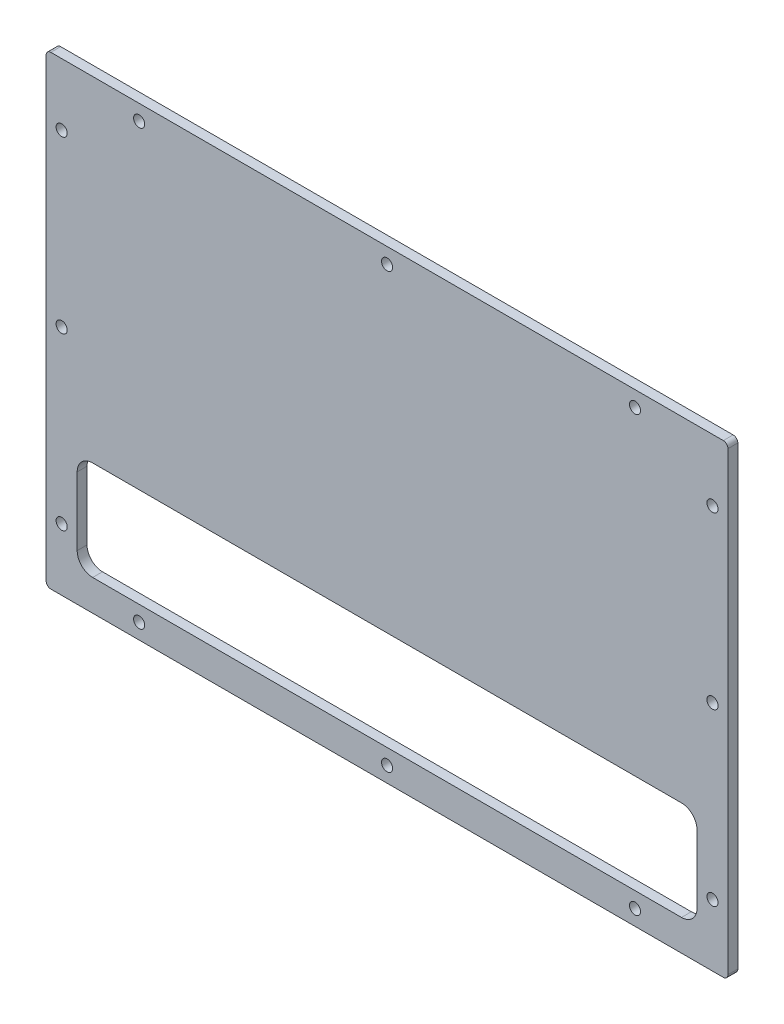
ISO-10303-21;
HEADER;
FILE_DESCRIPTION(('STEP AP214'),'2;1');
FILE_NAME('part.step','',(''),(''),'','','');
FILE_SCHEMA(('AUTOMOTIVE_DESIGN { 1 0 10303 214 1 1 1 1 }'));
ENDSEC;
DATA;
#1=APPLICATION_CONTEXT('core data for automotive mechanical design processes');
#2=APPLICATION_PROTOCOL_DEFINITION('international standard','automotive_design',2000,#1);
#3=PRODUCT_CONTEXT('',#1,'mechanical');
#4=PRODUCT('Part','Part','',(#3));
#5=PRODUCT_RELATED_PRODUCT_CATEGORY('part','',(#4));
#6=PRODUCT_DEFINITION_FORMATION('','',#4);
#7=PRODUCT_DEFINITION_CONTEXT('part definition',#1,'design');
#8=PRODUCT_DEFINITION('design','',#6,#7);
#9=PRODUCT_DEFINITION_SHAPE('','',#8);
#10=(LENGTH_UNIT() NAMED_UNIT(*) SI_UNIT(.MILLI.,.METRE.));
#11=(NAMED_UNIT(*) PLANE_ANGLE_UNIT() SI_UNIT($,.RADIAN.));
#12=(NAMED_UNIT(*) SI_UNIT($,.STERADIAN.) SOLID_ANGLE_UNIT());
#13=UNCERTAINTY_MEASURE_WITH_UNIT(LENGTH_MEASURE(1.E-05),#10,'distance_accuracy_value','');
#14=(GEOMETRIC_REPRESENTATION_CONTEXT(3) GLOBAL_UNCERTAINTY_ASSIGNED_CONTEXT((#13)) GLOBAL_UNIT_ASSIGNED_CONTEXT((#10,
#11,#12)) REPRESENTATION_CONTEXT('',''));
#15=CARTESIAN_POINT('',(0.,0.,0.));
#16=DIRECTION('',(0.,0.,1.));
#17=DIRECTION('',(1.,0.,0.));
#18=AXIS2_PLACEMENT_3D('',#15,#16,#17);
#19=CARTESIAN_POINT('',(0.,-75.,3.175));
#20=DIRECTION('',(0.,1.,0.));
#21=DIRECTION('',(0.,0.,1.));
#22=AXIS2_PLACEMENT_3D('',#19,#20,#21);
#23=PLANE('',#22);
#24=DIRECTION('',(1.,0.,0.));
#25=VECTOR('',#24,1.);
#26=CARTESIAN_POINT('',(0.,-75.,3.175));
#27=LINE('',#26,#25);
#28=CARTESIAN_POINT('',(-108.5,-75.,3.175));
#29=VERTEX_POINT('',#28);
#30=CARTESIAN_POINT('',(108.5,-75.,3.175));
#31=VERTEX_POINT('',#30);
#32=EDGE_CURVE('E177',#29,#31,#27,.T.);
#33=ORIENTED_EDGE('',*,*,#32,.F.);
#34=DIRECTION('',(0.,0.,-1.));
#35=VECTOR('',#34,1.);
#36=CARTESIAN_POINT('',(-108.5,-75.,0.));
#37=LINE('',#36,#35);
#38=CARTESIAN_POINT('',(-108.5,-75.,0.));
#39=VERTEX_POINT('',#38);
#40=EDGE_CURVE('E162',#29,#39,#37,.T.);
#41=ORIENTED_EDGE('',*,*,#40,.T.);
#42=DIRECTION('',(1.,0.,0.));
#43=VECTOR('',#42,1.);
#44=CARTESIAN_POINT('',(0.,-75.,0.));
#45=LINE('',#44,#43);
#46=CARTESIAN_POINT('',(108.5,-75.,0.));
#47=VERTEX_POINT('',#46);
#48=EDGE_CURVE('E174',#39,#47,#45,.T.);
#49=ORIENTED_EDGE('',*,*,#48,.T.);
#50=DIRECTION('',(0.,0.,-1.));
#51=VECTOR('',#50,1.);
#52=CARTESIAN_POINT('',(108.5,-75.,3.175));
#53=LINE('',#52,#51);
#54=EDGE_CURVE('E179',#47,#31,#53,.F.);
#55=ORIENTED_EDGE('',*,*,#54,.T.);
#56=EDGE_LOOP('',(#33,#41,#49,#55));
#57=FACE_BOUND('',#56,.T.);
#58=ADVANCED_FACE('F44',(#57),#23,.F.);
#59=CARTESIAN_POINT('',(110.,0.,3.175));
#60=DIRECTION('',(-1.,0.,0.));
#61=DIRECTION('',(0.,0.,1.));
#62=AXIS2_PLACEMENT_3D('',#59,#60,#61);
#63=PLANE('',#62);
#64=DIRECTION('',(0.,1.,0.));
#65=VECTOR('',#64,1.);
#66=CARTESIAN_POINT('',(110.,0.,3.175));
#67=LINE('',#66,#65);
#68=CARTESIAN_POINT('',(110.,-73.5,3.175));
#69=VERTEX_POINT('',#68);
#70=CARTESIAN_POINT('',(110.,73.5,3.175));
#71=VERTEX_POINT('',#70);
#72=EDGE_CURVE('E362',#69,#71,#67,.T.);
#73=ORIENTED_EDGE('',*,*,#72,.F.);
#74=DIRECTION('',(0.,0.,-1.));
#75=VECTOR('',#74,1.);
#76=CARTESIAN_POINT('',(110.,-73.5,3.175));
#77=LINE('',#76,#75);
#78=CARTESIAN_POINT('',(110.,-73.5,0.));
#79=VERTEX_POINT('',#78);
#80=EDGE_CURVE('E218',#69,#79,#77,.T.);
#81=ORIENTED_EDGE('',*,*,#80,.T.);
#82=DIRECTION('',(0.,1.,0.));
#83=VECTOR('',#82,1.);
#84=CARTESIAN_POINT('',(110.,0.,0.));
#85=LINE('',#84,#83);
#86=CARTESIAN_POINT('',(110.,73.5,0.));
#87=VERTEX_POINT('',#86);
#88=EDGE_CURVE('E183',#79,#87,#85,.T.);
#89=ORIENTED_EDGE('',*,*,#88,.T.);
#90=DIRECTION('',(0.,0.,-1.));
#91=VECTOR('',#90,1.);
#92=CARTESIAN_POINT('',(110.,73.5,3.175));
#93=LINE('',#92,#91);
#94=EDGE_CURVE('E216',#87,#71,#93,.F.);
#95=ORIENTED_EDGE('',*,*,#94,.T.);
#96=EDGE_LOOP('',(#73,#81,#89,#95));
#97=FACE_BOUND('',#96,.T.);
#98=ADVANCED_FACE('F387',(#97),#63,.F.);
#99=CARTESIAN_POINT('',(0.,75.,3.175));
#100=DIRECTION('',(0.,1.,0.));
#101=DIRECTION('',(0.,0.,1.));
#102=AXIS2_PLACEMENT_3D('',#99,#100,#101);
#103=PLANE('',#102);
#104=DIRECTION('',(1.,0.,0.));
#105=VECTOR('',#104,1.);
#106=CARTESIAN_POINT('',(0.,75.,3.175));
#107=LINE('',#106,#105);
#108=CARTESIAN_POINT('',(-108.5,75.,3.175));
#109=VERTEX_POINT('',#108);
#110=CARTESIAN_POINT('',(108.5,75.,3.175));
#111=VERTEX_POINT('',#110);
#112=EDGE_CURVE('E364',#109,#111,#107,.T.);
#113=ORIENTED_EDGE('',*,*,#112,.T.);
#114=DIRECTION('',(0.,0.,-1.));
#115=VECTOR('',#114,1.);
#116=CARTESIAN_POINT('',(108.5,75.,0.));
#117=LINE('',#116,#115);
#118=CARTESIAN_POINT('',(108.5,75.,0.));
#119=VERTEX_POINT('',#118);
#120=EDGE_CURVE('E223',#111,#119,#117,.T.);
#121=ORIENTED_EDGE('',*,*,#120,.T.);
#122=DIRECTION('',(1.,0.,0.));
#123=VECTOR('',#122,1.);
#124=CARTESIAN_POINT('',(0.,75.,0.));
#125=LINE('',#124,#123);
#126=CARTESIAN_POINT('',(-108.5,75.,0.));
#127=VERTEX_POINT('',#126);
#128=EDGE_CURVE('E187',#127,#119,#125,.T.);
#129=ORIENTED_EDGE('',*,*,#128,.F.);
#130=DIRECTION('',(0.,0.,-1.));
#131=VECTOR('',#130,1.);
#132=CARTESIAN_POINT('',(-108.5,75.,3.175));
#133=LINE('',#132,#131);
#134=EDGE_CURVE('E221',#127,#109,#133,.F.);
#135=ORIENTED_EDGE('',*,*,#134,.T.);
#136=EDGE_LOOP('',(#113,#121,#129,#135));
#137=FACE_BOUND('',#136,.T.);
#138=ADVANCED_FACE('F380',(#137),#103,.T.);
#139=CARTESIAN_POINT('',(-110.,0.,3.175));
#140=DIRECTION('',(-1.,0.,0.));
#141=DIRECTION('',(0.,0.,1.));
#142=AXIS2_PLACEMENT_3D('',#139,#140,#141);
#143=PLANE('',#142);
#144=DIRECTION('',(0.,1.,0.));
#145=VECTOR('',#144,1.);
#146=CARTESIAN_POINT('',(-110.,0.,0.));
#147=LINE('',#146,#145);
#148=CARTESIAN_POINT('',(-110.,-73.5,0.));
#149=VERTEX_POINT('',#148);
#150=CARTESIAN_POINT('',(-110.,73.5,0.));
#151=VERTEX_POINT('',#150);
#152=EDGE_CURVE('E198',#149,#151,#147,.T.);
#153=ORIENTED_EDGE('',*,*,#152,.F.);
#154=DIRECTION('',(0.,0.,-1.));
#155=VECTOR('',#154,1.);
#156=CARTESIAN_POINT('',(-110.,-73.5,3.175));
#157=LINE('',#156,#155);
#158=CARTESIAN_POINT('',(-110.,-73.5,3.175));
#159=VERTEX_POINT('',#158);
#160=EDGE_CURVE('E163',#149,#159,#157,.F.);
#161=ORIENTED_EDGE('',*,*,#160,.T.);
#162=DIRECTION('',(0.,1.,0.));
#163=VECTOR('',#162,1.);
#164=CARTESIAN_POINT('',(-110.,0.,3.175));
#165=LINE('',#164,#163);
#166=CARTESIAN_POINT('',(-110.,73.5,3.175));
#167=VERTEX_POINT('',#166);
#168=EDGE_CURVE('E193',#159,#167,#165,.T.);
#169=ORIENTED_EDGE('',*,*,#168,.T.);
#170=DIRECTION('',(0.,0.,-1.));
#171=VECTOR('',#170,1.);
#172=CARTESIAN_POINT('',(-110.,73.5,3.175));
#173=LINE('',#172,#171);
#174=EDGE_CURVE('E168',#167,#151,#173,.T.);
#175=ORIENTED_EDGE('',*,*,#174,.T.);
#176=EDGE_LOOP('',(#153,#161,#169,#175));
#177=FACE_BOUND('',#176,.T.);
#178=ADVANCED_FACE('F373',(#177),#143,.T.);
#179=CARTESIAN_POINT('',(0.,0.,3.175));
#180=DIRECTION('',(0.,0.,1.));
#181=DIRECTION('',(1.,0.,0.));
#182=AXIS2_PLACEMENT_3D('',#179,#180,#181);
#183=PLANE('',#182);
#184=DIRECTION('',(0.,1.,0.));
#185=VECTOR('',#184,1.);
#186=CARTESIAN_POINT('',(100.,-65.,3.175));
#187=LINE('',#186,#185);
#188=CARTESIAN_POINT('',(100.,-60.,3.175));
#189=VERTEX_POINT('',#188);
#190=CARTESIAN_POINT('',(100.,-38.,3.175));
#191=VERTEX_POINT('',#190);
#192=EDGE_CURVE('E260',#189,#191,#187,.T.);
#193=ORIENTED_EDGE('',*,*,#192,.F.);
#194=CARTESIAN_POINT('',(95.,-60.,3.175));
#195=DIRECTION('',(0.,0.,1.));
#196=DIRECTION('',(1.,0.,0.));
#197=AXIS2_PLACEMENT_3D('',#194,#195,#196);
#198=CIRCLE('',#197,5.);
#199=CARTESIAN_POINT('',(95.,-65.,3.175));
#200=VERTEX_POINT('',#199);
#201=EDGE_CURVE('E253',#189,#200,#198,.F.);
#202=ORIENTED_EDGE('',*,*,#201,.T.);
#203=DIRECTION('',(1.,0.,0.));
#204=VECTOR('',#203,1.);
#205=CARTESIAN_POINT('',(-100.,-65.,3.175));
#206=LINE('',#205,#204);
#207=CARTESIAN_POINT('',(-95.,-65.,3.175));
#208=VERTEX_POINT('',#207);
#209=EDGE_CURVE('E283',#208,#200,#206,.T.);
#210=ORIENTED_EDGE('',*,*,#209,.F.);
#211=CARTESIAN_POINT('',(-95.,-60.,3.175));
#212=DIRECTION('',(0.,0.,1.));
#213=DIRECTION('',(1.,0.,0.));
#214=AXIS2_PLACEMENT_3D('',#211,#212,#213);
#215=CIRCLE('',#214,5.);
#216=CARTESIAN_POINT('',(-100.,-60.,3.175));
#217=VERTEX_POINT('',#216);
#218=EDGE_CURVE('E245',#208,#217,#215,.F.);
#219=ORIENTED_EDGE('',*,*,#218,.T.);
#220=DIRECTION('',(0.,-1.,0.));
#221=VECTOR('',#220,1.);
#222=CARTESIAN_POINT('',(-100.,-65.,3.175));
#223=LINE('',#222,#221);
#224=CARTESIAN_POINT('',(-100.,-38.,3.175));
#225=VERTEX_POINT('',#224);
#226=EDGE_CURVE('E289',#225,#217,#223,.T.);
#227=ORIENTED_EDGE('',*,*,#226,.F.);
#228=CARTESIAN_POINT('',(-95.,-38.,3.175));
#229=DIRECTION('',(0.,0.,1.));
#230=DIRECTION('',(1.,0.,0.));
#231=AXIS2_PLACEMENT_3D('',#228,#229,#230);
#232=CIRCLE('',#231,5.);
#233=CARTESIAN_POINT('',(-95.,-33.,3.175));
#234=VERTEX_POINT('',#233);
#235=EDGE_CURVE('E249',#225,#234,#232,.F.);
#236=ORIENTED_EDGE('',*,*,#235,.T.);
#237=DIRECTION('',(-1.,0.,0.));
#238=VECTOR('',#237,1.);
#239=CARTESIAN_POINT('',(-100.,-33.,3.175));
#240=LINE('',#239,#238);
#241=CARTESIAN_POINT('',(95.,-33.,3.175));
#242=VERTEX_POINT('',#241);
#243=EDGE_CURVE('E262',#242,#234,#240,.T.);
#244=ORIENTED_EDGE('',*,*,#243,.F.);
#245=CARTESIAN_POINT('',(95.,-38.,3.175));
#246=DIRECTION('',(0.,0.,1.));
#247=DIRECTION('',(1.,0.,0.));
#248=AXIS2_PLACEMENT_3D('',#245,#246,#247);
#249=CIRCLE('',#248,5.);
#250=EDGE_CURVE('E52',#242,#191,#249,.F.);
#251=ORIENTED_EDGE('',*,*,#250,.T.);
#252=EDGE_LOOP('',(#193,#202,#210,#219,#227,#236,#244,#251));
#253=FACE_BOUND('',#252,.T.);
#254=CARTESIAN_POINT('',(-80.,70.,3.175));
#255=DIRECTION('',(0.,0.,1.));
#256=DIRECTION('',(1.,0.,0.));
#257=AXIS2_PLACEMENT_3D('',#254,#255,#256);
#258=CIRCLE('',#257,1.8);
#259=CARTESIAN_POINT('',(-78.2,70.,3.175));
#260=VERTEX_POINT('',#259);
#261=EDGE_CURVE('E286',#260,#260,#258,.T.);
#262=ORIENTED_EDGE('',*,*,#261,.F.);
#263=EDGE_LOOP('',(#262));
#264=FACE_BOUND('',#263,.T.);
#265=CARTESIAN_POINT('',(80.,70.,3.175));
#266=DIRECTION('',(0.,0.,1.));
#267=DIRECTION('',(1.,0.,0.));
#268=AXIS2_PLACEMENT_3D('',#265,#266,#267);
#269=CIRCLE('',#268,1.8);
#270=CARTESIAN_POINT('',(81.8,70.,3.175));
#271=VERTEX_POINT('',#270);
#272=EDGE_CURVE('E299',#271,#271,#269,.T.);
#273=ORIENTED_EDGE('',*,*,#272,.F.);
#274=EDGE_LOOP('',(#273));
#275=FACE_BOUND('',#274,.T.);
#276=CARTESIAN_POINT('',(0.,70.,3.175));
#277=DIRECTION('',(0.,0.,1.));
#278=DIRECTION('',(1.,0.,0.));
#279=AXIS2_PLACEMENT_3D('',#276,#277,#278);
#280=CIRCLE('',#279,1.8);
#281=CARTESIAN_POINT('',(1.8,70.,3.175));
#282=VERTEX_POINT('',#281);
#283=EDGE_CURVE('E305',#282,#282,#280,.T.);
#284=ORIENTED_EDGE('',*,*,#283,.F.);
#285=EDGE_LOOP('',(#284));
#286=FACE_BOUND('',#285,.T.);
#287=CARTESIAN_POINT('',(-105.,55.,3.175));
#288=DIRECTION('',(0.,0.,1.));
#289=DIRECTION('',(1.,0.,0.));
#290=AXIS2_PLACEMENT_3D('',#287,#288,#289);
#291=CIRCLE('',#290,1.8);
#292=CARTESIAN_POINT('',(-103.2,55.,3.175));
#293=VERTEX_POINT('',#292);
#294=EDGE_CURVE('E311',#293,#293,#291,.T.);
#295=ORIENTED_EDGE('',*,*,#294,.F.);
#296=EDGE_LOOP('',(#295));
#297=FACE_BOUND('',#296,.T.);
#298=CARTESIAN_POINT('',(-105.,0.,3.175));
#299=DIRECTION('',(0.,0.,1.));
#300=DIRECTION('',(1.,0.,0.));
#301=AXIS2_PLACEMENT_3D('',#298,#299,#300);
#302=CIRCLE('',#301,1.8);
#303=CARTESIAN_POINT('',(-103.2,0.,3.175));
#304=VERTEX_POINT('',#303);
#305=EDGE_CURVE('E317',#304,#304,#302,.T.);
#306=ORIENTED_EDGE('',*,*,#305,.F.);
#307=EDGE_LOOP('',(#306));
#308=FACE_BOUND('',#307,.T.);
#309=CARTESIAN_POINT('',(-105.,-55.,3.175));
#310=DIRECTION('',(0.,0.,1.));
#311=DIRECTION('',(1.,0.,0.));
#312=AXIS2_PLACEMENT_3D('',#309,#310,#311);
#313=CIRCLE('',#312,1.8);
#314=CARTESIAN_POINT('',(-103.2,-55.,3.175));
#315=VERTEX_POINT('',#314);
#316=EDGE_CURVE('E323',#315,#315,#313,.T.);
#317=ORIENTED_EDGE('',*,*,#316,.F.);
#318=EDGE_LOOP('',(#317));
#319=FACE_BOUND('',#318,.T.);
#320=CARTESIAN_POINT('',(-80.,-70.,3.175));
#321=DIRECTION('',(0.,0.,1.));
#322=DIRECTION('',(1.,0.,0.));
#323=AXIS2_PLACEMENT_3D('',#320,#321,#322);
#324=CIRCLE('',#323,1.8);
#325=CARTESIAN_POINT('',(-78.2,-70.,3.175));
#326=VERTEX_POINT('',#325);
#327=EDGE_CURVE('E329',#326,#326,#324,.T.);
#328=ORIENTED_EDGE('',*,*,#327,.F.);
#329=EDGE_LOOP('',(#328));
#330=FACE_BOUND('',#329,.T.);
#331=CARTESIAN_POINT('',(0.,-70.,3.175));
#332=DIRECTION('',(0.,0.,1.));
#333=DIRECTION('',(1.,0.,0.));
#334=AXIS2_PLACEMENT_3D('',#331,#332,#333);
#335=CIRCLE('',#334,1.8);
#336=CARTESIAN_POINT('',(1.80000000000003,-70.,3.175));
#337=VERTEX_POINT('',#336);
#338=EDGE_CURVE('E335',#337,#337,#335,.T.);
#339=ORIENTED_EDGE('',*,*,#338,.F.);
#340=EDGE_LOOP('',(#339));
#341=FACE_BOUND('',#340,.T.);
#342=CARTESIAN_POINT('',(80.,-69.9999999999999,3.175));
#343=DIRECTION('',(0.,0.,1.));
#344=DIRECTION('',(1.,0.,0.));
#345=AXIS2_PLACEMENT_3D('',#342,#343,#344);
#346=CIRCLE('',#345,1.8);
#347=CARTESIAN_POINT('',(81.8,-69.9999999999999,3.175));
#348=VERTEX_POINT('',#347);
#349=EDGE_CURVE('E341',#348,#348,#346,.T.);
#350=ORIENTED_EDGE('',*,*,#349,.F.);
#351=EDGE_LOOP('',(#350));
#352=FACE_BOUND('',#351,.T.);
#353=CARTESIAN_POINT('',(105.,-55.,3.175));
#354=DIRECTION('',(0.,0.,1.));
#355=DIRECTION('',(1.,0.,0.));
#356=AXIS2_PLACEMENT_3D('',#353,#354,#355);
#357=CIRCLE('',#356,1.8);
#358=CARTESIAN_POINT('',(106.8,-55.,3.175));
#359=VERTEX_POINT('',#358);
#360=EDGE_CURVE('E347',#359,#359,#357,.T.);
#361=ORIENTED_EDGE('',*,*,#360,.F.);
#362=EDGE_LOOP('',(#361));
#363=FACE_BOUND('',#362,.T.);
#364=CARTESIAN_POINT('',(105.,0.,3.175));
#365=DIRECTION('',(0.,0.,1.));
#366=DIRECTION('',(1.,0.,0.));
#367=AXIS2_PLACEMENT_3D('',#364,#365,#366);
#368=CIRCLE('',#367,1.8);
#369=CARTESIAN_POINT('',(106.8,0.,3.175));
#370=VERTEX_POINT('',#369);
#371=EDGE_CURVE('E353',#370,#370,#368,.T.);
#372=ORIENTED_EDGE('',*,*,#371,.F.);
#373=EDGE_LOOP('',(#372));
#374=FACE_BOUND('',#373,.T.);
#375=CARTESIAN_POINT('',(105.,55.,3.175));
#376=DIRECTION('',(0.,0.,1.));
#377=DIRECTION('',(1.,0.,0.));
#378=AXIS2_PLACEMENT_3D('',#375,#376,#377);
#379=CIRCLE('',#378,1.8);
#380=CARTESIAN_POINT('',(106.8,55.,3.175));
#381=VERTEX_POINT('',#380);
#382=EDGE_CURVE('E190',#381,#381,#379,.T.);
#383=ORIENTED_EDGE('',*,*,#382,.F.);
#384=EDGE_LOOP('',(#383));
#385=FACE_BOUND('',#384,.T.);
#386=ORIENTED_EDGE('',*,*,#168,.F.);
#387=CARTESIAN_POINT('',(-108.5,-73.5,3.175));
#388=DIRECTION('',(0.,0.,1.));
#389=DIRECTION('',(1.,0.,0.));
#390=AXIS2_PLACEMENT_3D('',#387,#388,#389);
#391=CIRCLE('',#390,1.5);
#392=EDGE_CURVE('E214',#159,#29,#391,.T.);
#393=ORIENTED_EDGE('',*,*,#392,.T.);
#394=ORIENTED_EDGE('',*,*,#32,.T.);
#395=CARTESIAN_POINT('',(108.5,-73.5,3.175));
#396=DIRECTION('',(0.,0.,1.));
#397=DIRECTION('',(1.,0.,0.));
#398=AXIS2_PLACEMENT_3D('',#395,#396,#397);
#399=CIRCLE('',#398,1.5);
#400=EDGE_CURVE('E212',#31,#69,#399,.T.);
#401=ORIENTED_EDGE('',*,*,#400,.T.);
#402=ORIENTED_EDGE('',*,*,#72,.T.);
#403=CARTESIAN_POINT('',(108.5,73.5,3.175));
#404=DIRECTION('',(0.,0.,1.));
#405=DIRECTION('',(1.,0.,0.));
#406=AXIS2_PLACEMENT_3D('',#403,#404,#405);
#407=CIRCLE('',#406,1.5);
#408=EDGE_CURVE('E210',#71,#111,#407,.T.);
#409=ORIENTED_EDGE('',*,*,#408,.T.);
#410=ORIENTED_EDGE('',*,*,#112,.F.);
#411=CARTESIAN_POINT('',(-108.5,73.5,3.175));
#412=DIRECTION('',(0.,0.,1.));
#413=DIRECTION('',(1.,0.,0.));
#414=AXIS2_PLACEMENT_3D('',#411,#412,#413);
#415=CIRCLE('',#414,1.5);
#416=EDGE_CURVE('E208',#109,#167,#415,.T.);
#417=ORIENTED_EDGE('',*,*,#416,.T.);
#418=EDGE_LOOP('',(#386,#393,#394,#401,#402,#409,#410,#417));
#419=FACE_BOUND('',#418,.T.);
#420=ADVANCED_FACE('F258',(#253,#264,#275,#286,#297,#308,#319,#330,#341,#352,#363,#374,#385,
#419),#183,.T.);
#421=CARTESIAN_POINT('',(0.,0.,0.));
#422=DIRECTION('',(0.,0.,1.));
#423=DIRECTION('',(1.,0.,0.));
#424=AXIS2_PLACEMENT_3D('',#421,#422,#423);
#425=PLANE('',#424);
#426=DIRECTION('',(0.,-1.,0.));
#427=VECTOR('',#426,1.);
#428=CARTESIAN_POINT('',(-100.,-65.,0.));
#429=LINE('',#428,#427);
#430=CARTESIAN_POINT('',(-100.,-38.,0.));
#431=VERTEX_POINT('',#430);
#432=CARTESIAN_POINT('',(-100.,-60.,0.));
#433=VERTEX_POINT('',#432);
#434=EDGE_CURVE('E279',#431,#433,#429,.T.);
#435=ORIENTED_EDGE('',*,*,#434,.T.);
#436=CARTESIAN_POINT('',(-95.,-60.,0.));
#437=DIRECTION('',(0.,0.,1.));
#438=DIRECTION('',(1.,0.,0.));
#439=AXIS2_PLACEMENT_3D('',#436,#437,#438);
#440=CIRCLE('',#439,5.);
#441=CARTESIAN_POINT('',(-95.,-65.,0.));
#442=VERTEX_POINT('',#441);
#443=EDGE_CURVE('E247',#433,#442,#440,.T.);
#444=ORIENTED_EDGE('',*,*,#443,.T.);
#445=DIRECTION('',(1.,0.,0.));
#446=VECTOR('',#445,1.);
#447=CARTESIAN_POINT('',(-100.,-65.,0.));
#448=LINE('',#447,#446);
#449=CARTESIAN_POINT('',(95.,-65.,0.));
#450=VERTEX_POINT('',#449);
#451=EDGE_CURVE('E281',#442,#450,#448,.T.);
#452=ORIENTED_EDGE('',*,*,#451,.T.);
#453=CARTESIAN_POINT('',(95.,-60.,0.));
#454=DIRECTION('',(0.,0.,1.));
#455=DIRECTION('',(1.,0.,0.));
#456=AXIS2_PLACEMENT_3D('',#453,#454,#455);
#457=CIRCLE('',#456,5.);
#458=CARTESIAN_POINT('',(100.,-60.,0.));
#459=VERTEX_POINT('',#458);
#460=EDGE_CURVE('E66',#450,#459,#457,.T.);
#461=ORIENTED_EDGE('',*,*,#460,.T.);
#462=DIRECTION('',(0.,1.,0.));
#463=VECTOR('',#462,1.);
#464=CARTESIAN_POINT('',(100.,-65.,0.));
#465=LINE('',#464,#463);
#466=CARTESIAN_POINT('',(100.,-38.,0.));
#467=VERTEX_POINT('',#466);
#468=EDGE_CURVE('E275',#459,#467,#465,.T.);
#469=ORIENTED_EDGE('',*,*,#468,.T.);
#470=CARTESIAN_POINT('',(95.,-38.,0.));
#471=DIRECTION('',(0.,0.,1.));
#472=DIRECTION('',(1.,0.,0.));
#473=AXIS2_PLACEMENT_3D('',#470,#471,#472);
#474=CIRCLE('',#473,5.);
#475=CARTESIAN_POINT('',(95.,-33.,0.));
#476=VERTEX_POINT('',#475);
#477=EDGE_CURVE('E11',#467,#476,#474,.T.);
#478=ORIENTED_EDGE('',*,*,#477,.T.);
#479=DIRECTION('',(-1.,0.,0.));
#480=VECTOR('',#479,1.);
#481=CARTESIAN_POINT('',(-100.,-33.,0.));
#482=LINE('',#481,#480);
#483=CARTESIAN_POINT('',(-95.,-33.,0.));
#484=VERTEX_POINT('',#483);
#485=EDGE_CURVE('E273',#476,#484,#482,.T.);
#486=ORIENTED_EDGE('',*,*,#485,.T.);
#487=CARTESIAN_POINT('',(-95.,-38.,0.));
#488=DIRECTION('',(0.,0.,1.));
#489=DIRECTION('',(1.,0.,0.));
#490=AXIS2_PLACEMENT_3D('',#487,#488,#489);
#491=CIRCLE('',#490,5.);
#492=EDGE_CURVE('E251',#484,#431,#491,.T.);
#493=ORIENTED_EDGE('',*,*,#492,.T.);
#494=EDGE_LOOP('',(#435,#444,#452,#461,#469,#478,#486,#493));
#495=FACE_BOUND('',#494,.T.);
#496=CARTESIAN_POINT('',(-80.,70.,0.));
#497=DIRECTION('',(0.,0.,1.));
#498=DIRECTION('',(1.,0.,0.));
#499=AXIS2_PLACEMENT_3D('',#496,#497,#498);
#500=CIRCLE('',#499,1.8);
#501=CARTESIAN_POINT('',(-78.2,70.,0.));
#502=VERTEX_POINT('',#501);
#503=EDGE_CURVE('E296',#502,#502,#500,.T.);
#504=ORIENTED_EDGE('',*,*,#503,.T.);
#505=EDGE_LOOP('',(#504));
#506=FACE_BOUND('',#505,.T.);
#507=CARTESIAN_POINT('',(80.,70.,0.));
#508=DIRECTION('',(0.,0.,1.));
#509=DIRECTION('',(1.,0.,0.));
#510=AXIS2_PLACEMENT_3D('',#507,#508,#509);
#511=CIRCLE('',#510,1.8);
#512=CARTESIAN_POINT('',(81.8,70.,0.));
#513=VERTEX_POINT('',#512);
#514=EDGE_CURVE('E302',#513,#513,#511,.T.);
#515=ORIENTED_EDGE('',*,*,#514,.T.);
#516=EDGE_LOOP('',(#515));
#517=FACE_BOUND('',#516,.T.);
#518=CARTESIAN_POINT('',(0.,70.,0.));
#519=DIRECTION('',(0.,0.,1.));
#520=DIRECTION('',(1.,0.,0.));
#521=AXIS2_PLACEMENT_3D('',#518,#519,#520);
#522=CIRCLE('',#521,1.8);
#523=CARTESIAN_POINT('',(1.8,70.,0.));
#524=VERTEX_POINT('',#523);
#525=EDGE_CURVE('E308',#524,#524,#522,.T.);
#526=ORIENTED_EDGE('',*,*,#525,.T.);
#527=EDGE_LOOP('',(#526));
#528=FACE_BOUND('',#527,.T.);
#529=CARTESIAN_POINT('',(-105.,55.,0.));
#530=DIRECTION('',(0.,0.,1.));
#531=DIRECTION('',(1.,0.,0.));
#532=AXIS2_PLACEMENT_3D('',#529,#530,#531);
#533=CIRCLE('',#532,1.8);
#534=CARTESIAN_POINT('',(-103.2,55.,0.));
#535=VERTEX_POINT('',#534);
#536=EDGE_CURVE('E314',#535,#535,#533,.T.);
#537=ORIENTED_EDGE('',*,*,#536,.T.);
#538=EDGE_LOOP('',(#537));
#539=FACE_BOUND('',#538,.T.);
#540=CARTESIAN_POINT('',(-105.,0.,0.));
#541=DIRECTION('',(0.,0.,1.));
#542=DIRECTION('',(1.,0.,0.));
#543=AXIS2_PLACEMENT_3D('',#540,#541,#542);
#544=CIRCLE('',#543,1.8);
#545=CARTESIAN_POINT('',(-103.2,0.,0.));
#546=VERTEX_POINT('',#545);
#547=EDGE_CURVE('E320',#546,#546,#544,.T.);
#548=ORIENTED_EDGE('',*,*,#547,.T.);
#549=EDGE_LOOP('',(#548));
#550=FACE_BOUND('',#549,.T.);
#551=CARTESIAN_POINT('',(-105.,-55.,0.));
#552=DIRECTION('',(0.,0.,1.));
#553=DIRECTION('',(1.,0.,0.));
#554=AXIS2_PLACEMENT_3D('',#551,#552,#553);
#555=CIRCLE('',#554,1.8);
#556=CARTESIAN_POINT('',(-103.2,-55.,0.));
#557=VERTEX_POINT('',#556);
#558=EDGE_CURVE('E326',#557,#557,#555,.T.);
#559=ORIENTED_EDGE('',*,*,#558,.T.);
#560=EDGE_LOOP('',(#559));
#561=FACE_BOUND('',#560,.T.);
#562=CARTESIAN_POINT('',(-80.,-70.,0.));
#563=DIRECTION('',(0.,0.,1.));
#564=DIRECTION('',(1.,0.,0.));
#565=AXIS2_PLACEMENT_3D('',#562,#563,#564);
#566=CIRCLE('',#565,1.8);
#567=CARTESIAN_POINT('',(-78.2,-70.,0.));
#568=VERTEX_POINT('',#567);
#569=EDGE_CURVE('E332',#568,#568,#566,.T.);
#570=ORIENTED_EDGE('',*,*,#569,.T.);
#571=EDGE_LOOP('',(#570));
#572=FACE_BOUND('',#571,.T.);
#573=CARTESIAN_POINT('',(0.,-70.,0.));
#574=DIRECTION('',(0.,0.,1.));
#575=DIRECTION('',(1.,0.,0.));
#576=AXIS2_PLACEMENT_3D('',#573,#574,#575);
#577=CIRCLE('',#576,1.8);
#578=CARTESIAN_POINT('',(1.80000000000003,-70.,0.));
#579=VERTEX_POINT('',#578);
#580=EDGE_CURVE('E338',#579,#579,#577,.T.);
#581=ORIENTED_EDGE('',*,*,#580,.T.);
#582=EDGE_LOOP('',(#581));
#583=FACE_BOUND('',#582,.T.);
#584=CARTESIAN_POINT('',(80.,-69.9999999999999,0.));
#585=DIRECTION('',(0.,0.,1.));
#586=DIRECTION('',(1.,0.,0.));
#587=AXIS2_PLACEMENT_3D('',#584,#585,#586);
#588=CIRCLE('',#587,1.8);
#589=CARTESIAN_POINT('',(81.8,-69.9999999999999,0.));
#590=VERTEX_POINT('',#589);
#591=EDGE_CURVE('E344',#590,#590,#588,.T.);
#592=ORIENTED_EDGE('',*,*,#591,.T.);
#593=EDGE_LOOP('',(#592));
#594=FACE_BOUND('',#593,.T.);
#595=CARTESIAN_POINT('',(105.,-55.,0.));
#596=DIRECTION('',(0.,0.,1.));
#597=DIRECTION('',(1.,0.,0.));
#598=AXIS2_PLACEMENT_3D('',#595,#596,#597);
#599=CIRCLE('',#598,1.8);
#600=CARTESIAN_POINT('',(106.8,-55.,0.));
#601=VERTEX_POINT('',#600);
#602=EDGE_CURVE('E350',#601,#601,#599,.T.);
#603=ORIENTED_EDGE('',*,*,#602,.T.);
#604=EDGE_LOOP('',(#603));
#605=FACE_BOUND('',#604,.T.);
#606=CARTESIAN_POINT('',(105.,0.,0.));
#607=DIRECTION('',(0.,0.,1.));
#608=DIRECTION('',(1.,0.,0.));
#609=AXIS2_PLACEMENT_3D('',#606,#607,#608);
#610=CIRCLE('',#609,1.8);
#611=CARTESIAN_POINT('',(106.8,0.,0.));
#612=VERTEX_POINT('',#611);
#613=EDGE_CURVE('E356',#612,#612,#610,.T.);
#614=ORIENTED_EDGE('',*,*,#613,.T.);
#615=EDGE_LOOP('',(#614));
#616=FACE_BOUND('',#615,.T.);
#617=CARTESIAN_POINT('',(105.,55.,0.));
#618=DIRECTION('',(0.,0.,1.));
#619=DIRECTION('',(1.,0.,0.));
#620=AXIS2_PLACEMENT_3D('',#617,#618,#619);
#621=CIRCLE('',#620,1.8);
#622=CARTESIAN_POINT('',(106.8,55.,0.));
#623=VERTEX_POINT('',#622);
#624=EDGE_CURVE('E184',#623,#623,#621,.T.);
#625=ORIENTED_EDGE('',*,*,#624,.T.);
#626=EDGE_LOOP('',(#625));
#627=FACE_BOUND('',#626,.T.);
#628=ORIENTED_EDGE('',*,*,#48,.F.);
#629=CARTESIAN_POINT('',(-108.5,-73.5,0.));
#630=DIRECTION('',(0.,0.,1.));
#631=DIRECTION('',(1.,0.,0.));
#632=AXIS2_PLACEMENT_3D('',#629,#630,#631);
#633=CIRCLE('',#632,1.5);
#634=EDGE_CURVE('E158',#39,#149,#633,.F.);
#635=ORIENTED_EDGE('',*,*,#634,.T.);
#636=ORIENTED_EDGE('',*,*,#152,.T.);
#637=CARTESIAN_POINT('',(-108.5,73.5,0.));
#638=DIRECTION('',(0.,0.,1.));
#639=DIRECTION('',(1.,0.,0.));
#640=AXIS2_PLACEMENT_3D('',#637,#638,#639);
#641=CIRCLE('',#640,1.5);
#642=EDGE_CURVE('E178',#151,#127,#641,.F.);
#643=ORIENTED_EDGE('',*,*,#642,.T.);
#644=ORIENTED_EDGE('',*,*,#128,.T.);
#645=CARTESIAN_POINT('',(108.5,73.5,0.));
#646=DIRECTION('',(0.,0.,1.));
#647=DIRECTION('',(1.,0.,0.));
#648=AXIS2_PLACEMENT_3D('',#645,#646,#647);
#649=CIRCLE('',#648,1.5);
#650=EDGE_CURVE('E202',#119,#87,#649,.F.);
#651=ORIENTED_EDGE('',*,*,#650,.T.);
#652=ORIENTED_EDGE('',*,*,#88,.F.);
#653=CARTESIAN_POINT('',(108.5,-73.5,0.));
#654=DIRECTION('',(0.,0.,1.));
#655=DIRECTION('',(1.,0.,0.));
#656=AXIS2_PLACEMENT_3D('',#653,#654,#655);
#657=CIRCLE('',#656,1.5);
#658=EDGE_CURVE('E169',#79,#47,#657,.F.);
#659=ORIENTED_EDGE('',*,*,#658,.T.);
#660=EDGE_LOOP('',(#628,#635,#636,#643,#644,#651,#652,#659));
#661=FACE_BOUND('',#660,.T.);
#662=ADVANCED_FACE('F181',(#495,#506,#517,#528,#539,#550,#561,#572,#583,#594,#605,#616,#627,
#661),#425,.F.);
#663=CARTESIAN_POINT('',(105.,55.,3.175));
#664=DIRECTION('',(0.,0.,1.));
#665=DIRECTION('',(1.,0.,0.));
#666=AXIS2_PLACEMENT_3D('',#663,#664,#665);
#667=CYLINDRICAL_SURFACE('',#666,1.8);
#668=ORIENTED_EDGE('',*,*,#624,.F.);
#669=EDGE_LOOP('',(#668));
#670=FACE_BOUND('',#669,.T.);
#671=ORIENTED_EDGE('',*,*,#382,.T.);
#672=EDGE_LOOP('',(#671));
#673=FACE_BOUND('',#672,.T.);
#674=ADVANCED_FACE('F398',(#670,#673),#667,.F.);
#675=CARTESIAN_POINT('',(105.,0.,3.175));
#676=DIRECTION('',(0.,0.,1.));
#677=DIRECTION('',(1.,0.,0.));
#678=AXIS2_PLACEMENT_3D('',#675,#676,#677);
#679=CYLINDRICAL_SURFACE('',#678,1.8);
#680=ORIENTED_EDGE('',*,*,#613,.F.);
#681=EDGE_LOOP('',(#680));
#682=FACE_BOUND('',#681,.T.);
#683=ORIENTED_EDGE('',*,*,#371,.T.);
#684=EDGE_LOOP('',(#683));
#685=FACE_BOUND('',#684,.T.);
#686=ADVANCED_FACE('F494',(#682,#685),#679,.F.);
#687=CARTESIAN_POINT('',(105.,-55.,3.175));
#688=DIRECTION('',(0.,0.,1.));
#689=DIRECTION('',(1.,0.,0.));
#690=AXIS2_PLACEMENT_3D('',#687,#688,#689);
#691=CYLINDRICAL_SURFACE('',#690,1.8);
#692=ORIENTED_EDGE('',*,*,#602,.F.);
#693=EDGE_LOOP('',(#692));
#694=FACE_BOUND('',#693,.T.);
#695=ORIENTED_EDGE('',*,*,#360,.T.);
#696=EDGE_LOOP('',(#695));
#697=FACE_BOUND('',#696,.T.);
#698=ADVANCED_FACE('F490',(#694,#697),#691,.F.);
#699=CARTESIAN_POINT('',(80.,-69.9999999999999,3.175));
#700=DIRECTION('',(0.,0.,1.));
#701=DIRECTION('',(1.,0.,0.));
#702=AXIS2_PLACEMENT_3D('',#699,#700,#701);
#703=CYLINDRICAL_SURFACE('',#702,1.8);
#704=ORIENTED_EDGE('',*,*,#591,.F.);
#705=EDGE_LOOP('',(#704));
#706=FACE_BOUND('',#705,.T.);
#707=ORIENTED_EDGE('',*,*,#349,.T.);
#708=EDGE_LOOP('',(#707));
#709=FACE_BOUND('',#708,.T.);
#710=ADVANCED_FACE('F486',(#706,#709),#703,.F.);
#711=CARTESIAN_POINT('',(0.,-70.,3.175));
#712=DIRECTION('',(0.,0.,1.));
#713=DIRECTION('',(1.,0.,0.));
#714=AXIS2_PLACEMENT_3D('',#711,#712,#713);
#715=CYLINDRICAL_SURFACE('',#714,1.8);
#716=ORIENTED_EDGE('',*,*,#580,.F.);
#717=EDGE_LOOP('',(#716));
#718=FACE_BOUND('',#717,.T.);
#719=ORIENTED_EDGE('',*,*,#338,.T.);
#720=EDGE_LOOP('',(#719));
#721=FACE_BOUND('',#720,.T.);
#722=ADVANCED_FACE('F482',(#718,#721),#715,.F.);
#723=CARTESIAN_POINT('',(-80.,-70.,3.175));
#724=DIRECTION('',(0.,0.,1.));
#725=DIRECTION('',(1.,0.,0.));
#726=AXIS2_PLACEMENT_3D('',#723,#724,#725);
#727=CYLINDRICAL_SURFACE('',#726,1.8);
#728=ORIENTED_EDGE('',*,*,#569,.F.);
#729=EDGE_LOOP('',(#728));
#730=FACE_BOUND('',#729,.T.);
#731=ORIENTED_EDGE('',*,*,#327,.T.);
#732=EDGE_LOOP('',(#731));
#733=FACE_BOUND('',#732,.T.);
#734=ADVANCED_FACE('F478',(#730,#733),#727,.F.);
#735=CARTESIAN_POINT('',(-105.,-55.,3.175));
#736=DIRECTION('',(0.,0.,1.));
#737=DIRECTION('',(1.,0.,0.));
#738=AXIS2_PLACEMENT_3D('',#735,#736,#737);
#739=CYLINDRICAL_SURFACE('',#738,1.8);
#740=ORIENTED_EDGE('',*,*,#558,.F.);
#741=EDGE_LOOP('',(#740));
#742=FACE_BOUND('',#741,.T.);
#743=ORIENTED_EDGE('',*,*,#316,.T.);
#744=EDGE_LOOP('',(#743));
#745=FACE_BOUND('',#744,.T.);
#746=ADVANCED_FACE('F474',(#742,#745),#739,.F.);
#747=CARTESIAN_POINT('',(-105.,0.,3.175));
#748=DIRECTION('',(0.,0.,1.));
#749=DIRECTION('',(1.,0.,0.));
#750=AXIS2_PLACEMENT_3D('',#747,#748,#749);
#751=CYLINDRICAL_SURFACE('',#750,1.8);
#752=ORIENTED_EDGE('',*,*,#547,.F.);
#753=EDGE_LOOP('',(#752));
#754=FACE_BOUND('',#753,.T.);
#755=ORIENTED_EDGE('',*,*,#305,.T.);
#756=EDGE_LOOP('',(#755));
#757=FACE_BOUND('',#756,.T.);
#758=ADVANCED_FACE('F470',(#754,#757),#751,.F.);
#759=CARTESIAN_POINT('',(-105.,55.,3.175));
#760=DIRECTION('',(0.,0.,1.));
#761=DIRECTION('',(1.,0.,0.));
#762=AXIS2_PLACEMENT_3D('',#759,#760,#761);
#763=CYLINDRICAL_SURFACE('',#762,1.8);
#764=ORIENTED_EDGE('',*,*,#536,.F.);
#765=EDGE_LOOP('',(#764));
#766=FACE_BOUND('',#765,.T.);
#767=ORIENTED_EDGE('',*,*,#294,.T.);
#768=EDGE_LOOP('',(#767));
#769=FACE_BOUND('',#768,.T.);
#770=ADVANCED_FACE('F466',(#766,#769),#763,.F.);
#771=CARTESIAN_POINT('',(0.,70.,3.175));
#772=DIRECTION('',(0.,0.,1.));
#773=DIRECTION('',(1.,0.,0.));
#774=AXIS2_PLACEMENT_3D('',#771,#772,#773);
#775=CYLINDRICAL_SURFACE('',#774,1.8);
#776=ORIENTED_EDGE('',*,*,#525,.F.);
#777=EDGE_LOOP('',(#776));
#778=FACE_BOUND('',#777,.T.);
#779=ORIENTED_EDGE('',*,*,#283,.T.);
#780=EDGE_LOOP('',(#779));
#781=FACE_BOUND('',#780,.T.);
#782=ADVANCED_FACE('F462',(#778,#781),#775,.F.);
#783=CARTESIAN_POINT('',(80.,70.,3.175));
#784=DIRECTION('',(0.,0.,1.));
#785=DIRECTION('',(1.,0.,0.));
#786=AXIS2_PLACEMENT_3D('',#783,#784,#785);
#787=CYLINDRICAL_SURFACE('',#786,1.8);
#788=ORIENTED_EDGE('',*,*,#514,.F.);
#789=EDGE_LOOP('',(#788));
#790=FACE_BOUND('',#789,.T.);
#791=ORIENTED_EDGE('',*,*,#272,.T.);
#792=EDGE_LOOP('',(#791));
#793=FACE_BOUND('',#792,.T.);
#794=ADVANCED_FACE('F458',(#790,#793),#787,.F.);
#795=CARTESIAN_POINT('',(-80.,70.,3.175));
#796=DIRECTION('',(0.,0.,1.));
#797=DIRECTION('',(1.,0.,0.));
#798=AXIS2_PLACEMENT_3D('',#795,#796,#797);
#799=CYLINDRICAL_SURFACE('',#798,1.8);
#800=ORIENTED_EDGE('',*,*,#503,.F.);
#801=EDGE_LOOP('',(#800));
#802=FACE_BOUND('',#801,.T.);
#803=ORIENTED_EDGE('',*,*,#261,.T.);
#804=EDGE_LOOP('',(#803));
#805=FACE_BOUND('',#804,.T.);
#806=ADVANCED_FACE('F412',(#802,#805),#799,.F.);
#807=CARTESIAN_POINT('',(-108.5,-73.5,3.175));
#808=DIRECTION('',(0.,0.,1.));
#809=DIRECTION('',(1.,0.,0.));
#810=AXIS2_PLACEMENT_3D('',#807,#808,#809);
#811=CYLINDRICAL_SURFACE('',#810,1.5);
#812=ORIENTED_EDGE('',*,*,#392,.F.);
#813=ORIENTED_EDGE('',*,*,#160,.F.);
#814=ORIENTED_EDGE('',*,*,#634,.F.);
#815=ORIENTED_EDGE('',*,*,#40,.F.);
#816=EDGE_LOOP('',(#812,#813,#814,#815));
#817=FACE_BOUND('',#816,.T.);
#818=ADVANCED_FACE('F161',(#817),#811,.T.);
#819=CARTESIAN_POINT('',(108.5,-73.5,3.175));
#820=DIRECTION('',(0.,0.,-1.));
#821=DIRECTION('',(-1.,0.,0.));
#822=AXIS2_PLACEMENT_3D('',#819,#820,#821);
#823=CYLINDRICAL_SURFACE('',#822,1.5);
#824=ORIENTED_EDGE('',*,*,#400,.F.);
#825=ORIENTED_EDGE('',*,*,#54,.F.);
#826=ORIENTED_EDGE('',*,*,#658,.F.);
#827=ORIENTED_EDGE('',*,*,#80,.F.);
#828=EDGE_LOOP('',(#824,#825,#826,#827));
#829=FACE_BOUND('',#828,.T.);
#830=ADVANCED_FACE('F391',(#829),#823,.T.);
#831=CARTESIAN_POINT('',(108.5,73.5,3.175));
#832=DIRECTION('',(0.,0.,1.));
#833=DIRECTION('',(1.,0.,0.));
#834=AXIS2_PLACEMENT_3D('',#831,#832,#833);
#835=CYLINDRICAL_SURFACE('',#834,1.5);
#836=ORIENTED_EDGE('',*,*,#408,.F.);
#837=ORIENTED_EDGE('',*,*,#94,.F.);
#838=ORIENTED_EDGE('',*,*,#650,.F.);
#839=ORIENTED_EDGE('',*,*,#120,.F.);
#840=EDGE_LOOP('',(#836,#837,#838,#839));
#841=FACE_BOUND('',#840,.T.);
#842=ADVANCED_FACE('F383',(#841),#835,.T.);
#843=CARTESIAN_POINT('',(-108.5,73.5,3.175));
#844=DIRECTION('',(0.,0.,-1.));
#845=DIRECTION('',(-1.,0.,0.));
#846=AXIS2_PLACEMENT_3D('',#843,#844,#845);
#847=CYLINDRICAL_SURFACE('',#846,1.5);
#848=ORIENTED_EDGE('',*,*,#416,.F.);
#849=ORIENTED_EDGE('',*,*,#134,.F.);
#850=ORIENTED_EDGE('',*,*,#642,.F.);
#851=ORIENTED_EDGE('',*,*,#174,.F.);
#852=EDGE_LOOP('',(#848,#849,#850,#851));
#853=FACE_BOUND('',#852,.T.);
#854=ADVANCED_FACE('F377',(#853),#847,.T.);
#855=CARTESIAN_POINT('',(100.,-65.,0.));
#856=DIRECTION('',(1.,0.,0.));
#857=DIRECTION('',(0.,0.,-1.));
#858=AXIS2_PLACEMENT_3D('',#855,#856,#857);
#859=PLANE('',#858);
#860=ORIENTED_EDGE('',*,*,#468,.F.);
#861=DIRECTION('',(0.,0.,1.));
#862=VECTOR('',#861,1.);
#863=CARTESIAN_POINT('',(100.,-60.,3.175));
#864=LINE('',#863,#862);
#865=EDGE_CURVE('E242',#459,#189,#864,.T.);
#866=ORIENTED_EDGE('',*,*,#865,.T.);
#867=ORIENTED_EDGE('',*,*,#192,.T.);
#868=DIRECTION('',(0.,0.,1.));
#869=VECTOR('',#868,1.);
#870=CARTESIAN_POINT('',(100.,-38.,0.));
#871=LINE('',#870,#869);
#872=EDGE_CURVE('E59',#191,#467,#871,.F.);
#873=ORIENTED_EDGE('',*,*,#872,.T.);
#874=EDGE_LOOP('',(#860,#866,#867,#873));
#875=FACE_BOUND('',#874,.T.);
#876=ADVANCED_FACE('F265',(#875),#859,.F.);
#877=CARTESIAN_POINT('',(-100.,-65.,0.));
#878=DIRECTION('',(0.,-1.,0.));
#879=DIRECTION('',(0.,0.,-1.));
#880=AXIS2_PLACEMENT_3D('',#877,#878,#879);
#881=PLANE('',#880);
#882=ORIENTED_EDGE('',*,*,#451,.F.);
#883=DIRECTION('',(0.,0.,1.));
#884=VECTOR('',#883,1.);
#885=CARTESIAN_POINT('',(-95.,-65.,3.175));
#886=LINE('',#885,#884);
#887=EDGE_CURVE('E228',#442,#208,#886,.T.);
#888=ORIENTED_EDGE('',*,*,#887,.T.);
#889=ORIENTED_EDGE('',*,*,#209,.T.);
#890=DIRECTION('',(0.,0.,1.));
#891=VECTOR('',#890,1.);
#892=CARTESIAN_POINT('',(95.,-65.,0.));
#893=LINE('',#892,#891);
#894=EDGE_CURVE('E226',#200,#450,#893,.F.);
#895=ORIENTED_EDGE('',*,*,#894,.T.);
#896=EDGE_LOOP('',(#882,#888,#889,#895));
#897=FACE_BOUND('',#896,.T.);
#898=ADVANCED_FACE('F436',(#897),#881,.F.);
#899=CARTESIAN_POINT('',(-100.,-65.,0.));
#900=DIRECTION('',(-1.,0.,0.));
#901=DIRECTION('',(0.,0.,1.));
#902=AXIS2_PLACEMENT_3D('',#899,#900,#901);
#903=PLANE('',#902);
#904=ORIENTED_EDGE('',*,*,#226,.T.);
#905=DIRECTION('',(0.,0.,1.));
#906=VECTOR('',#905,1.);
#907=CARTESIAN_POINT('',(-100.,-60.,0.));
#908=LINE('',#907,#906);
#909=EDGE_CURVE('E234',#217,#433,#908,.F.);
#910=ORIENTED_EDGE('',*,*,#909,.T.);
#911=ORIENTED_EDGE('',*,*,#434,.F.);
#912=DIRECTION('',(0.,0.,1.));
#913=VECTOR('',#912,1.);
#914=CARTESIAN_POINT('',(-100.,-38.,3.175));
#915=LINE('',#914,#913);
#916=EDGE_CURVE('E231',#431,#225,#915,.T.);
#917=ORIENTED_EDGE('',*,*,#916,.T.);
#918=EDGE_LOOP('',(#904,#910,#911,#917));
#919=FACE_BOUND('',#918,.T.);
#920=ADVANCED_FACE('F442',(#919),#903,.F.);
#921=CARTESIAN_POINT('',(-100.,-33.,0.));
#922=DIRECTION('',(0.,1.,0.));
#923=DIRECTION('',(0.,0.,1.));
#924=AXIS2_PLACEMENT_3D('',#921,#922,#923);
#925=PLANE('',#924);
#926=ORIENTED_EDGE('',*,*,#243,.T.);
#927=DIRECTION('',(0.,0.,1.));
#928=VECTOR('',#927,1.);
#929=CARTESIAN_POINT('',(-95.,-33.,0.));
#930=LINE('',#929,#928);
#931=EDGE_CURVE('E239',#234,#484,#930,.F.);
#932=ORIENTED_EDGE('',*,*,#931,.T.);
#933=ORIENTED_EDGE('',*,*,#485,.F.);
#934=DIRECTION('',(0.,0.,1.));
#935=VECTOR('',#934,1.);
#936=CARTESIAN_POINT('',(95.,-33.,3.175));
#937=LINE('',#936,#935);
#938=EDGE_CURVE('E236',#476,#242,#937,.T.);
#939=ORIENTED_EDGE('',*,*,#938,.T.);
#940=EDGE_LOOP('',(#926,#932,#933,#939));
#941=FACE_BOUND('',#940,.T.);
#942=ADVANCED_FACE('F277',(#941),#925,.F.);
#943=CARTESIAN_POINT('',(-95.,-60.,0.));
#944=DIRECTION('',(0.,0.,-1.));
#945=DIRECTION('',(-1.,0.,0.));
#946=AXIS2_PLACEMENT_3D('',#943,#944,#945);
#947=CYLINDRICAL_SURFACE('',#946,5.);
#948=ORIENTED_EDGE('',*,*,#443,.F.);
#949=ORIENTED_EDGE('',*,*,#909,.F.);
#950=ORIENTED_EDGE('',*,*,#218,.F.);
#951=ORIENTED_EDGE('',*,*,#887,.F.);
#952=EDGE_LOOP('',(#948,#949,#950,#951));
#953=FACE_BOUND('',#952,.T.);
#954=ADVANCED_FACE('F419',(#953),#947,.F.);
#955=CARTESIAN_POINT('',(-95.,-38.,0.));
#956=DIRECTION('',(0.,0.,-1.));
#957=DIRECTION('',(-1.,0.,0.));
#958=AXIS2_PLACEMENT_3D('',#955,#956,#957);
#959=CYLINDRICAL_SURFACE('',#958,5.);
#960=ORIENTED_EDGE('',*,*,#492,.F.);
#961=ORIENTED_EDGE('',*,*,#931,.F.);
#962=ORIENTED_EDGE('',*,*,#235,.F.);
#963=ORIENTED_EDGE('',*,*,#916,.F.);
#964=EDGE_LOOP('',(#960,#961,#962,#963));
#965=FACE_BOUND('',#964,.T.);
#966=ADVANCED_FACE('F422',(#965),#959,.F.);
#967=CARTESIAN_POINT('',(95.,-60.,0.));
#968=DIRECTION('',(0.,0.,-1.));
#969=DIRECTION('',(-1.,0.,0.));
#970=AXIS2_PLACEMENT_3D('',#967,#968,#969);
#971=CYLINDRICAL_SURFACE('',#970,5.);
#972=ORIENTED_EDGE('',*,*,#460,.F.);
#973=ORIENTED_EDGE('',*,*,#894,.F.);
#974=ORIENTED_EDGE('',*,*,#201,.F.);
#975=ORIENTED_EDGE('',*,*,#865,.F.);
#976=EDGE_LOOP('',(#972,#973,#974,#975));
#977=FACE_BOUND('',#976,.T.);
#978=ADVANCED_FACE('F425',(#977),#971,.F.);
#979=CARTESIAN_POINT('',(95.,-38.,0.));
#980=DIRECTION('',(0.,0.,-1.));
#981=DIRECTION('',(-1.,0.,0.));
#982=AXIS2_PLACEMENT_3D('',#979,#980,#981);
#983=CYLINDRICAL_SURFACE('',#982,5.);
#984=ORIENTED_EDGE('',*,*,#477,.F.);
#985=ORIENTED_EDGE('',*,*,#872,.F.);
#986=ORIENTED_EDGE('',*,*,#250,.F.);
#987=ORIENTED_EDGE('',*,*,#938,.F.);
#988=EDGE_LOOP('',(#984,#985,#986,#987));
#989=FACE_BOUND('',#988,.T.);
#990=ADVANCED_FACE('F46',(#989),#983,.F.);
#991=CLOSED_SHELL('',(#58,#98,#138,#178,#420,#662,#674,#686,#698,#710,#722,#734,#746,#758,#770,
#782,#794,#806,#818,#830,#842,#854,#876,#898,#920,#942,#954,#966,#978,#990));
#992=MANIFOLD_SOLID_BREP('B2',#991);
#993=ADVANCED_BREP_SHAPE_REPRESENTATION('',(#18,#992),#14);
#994=SHAPE_DEFINITION_REPRESENTATION(#9,#993);
ENDSEC;
END-ISO-10303-21;
